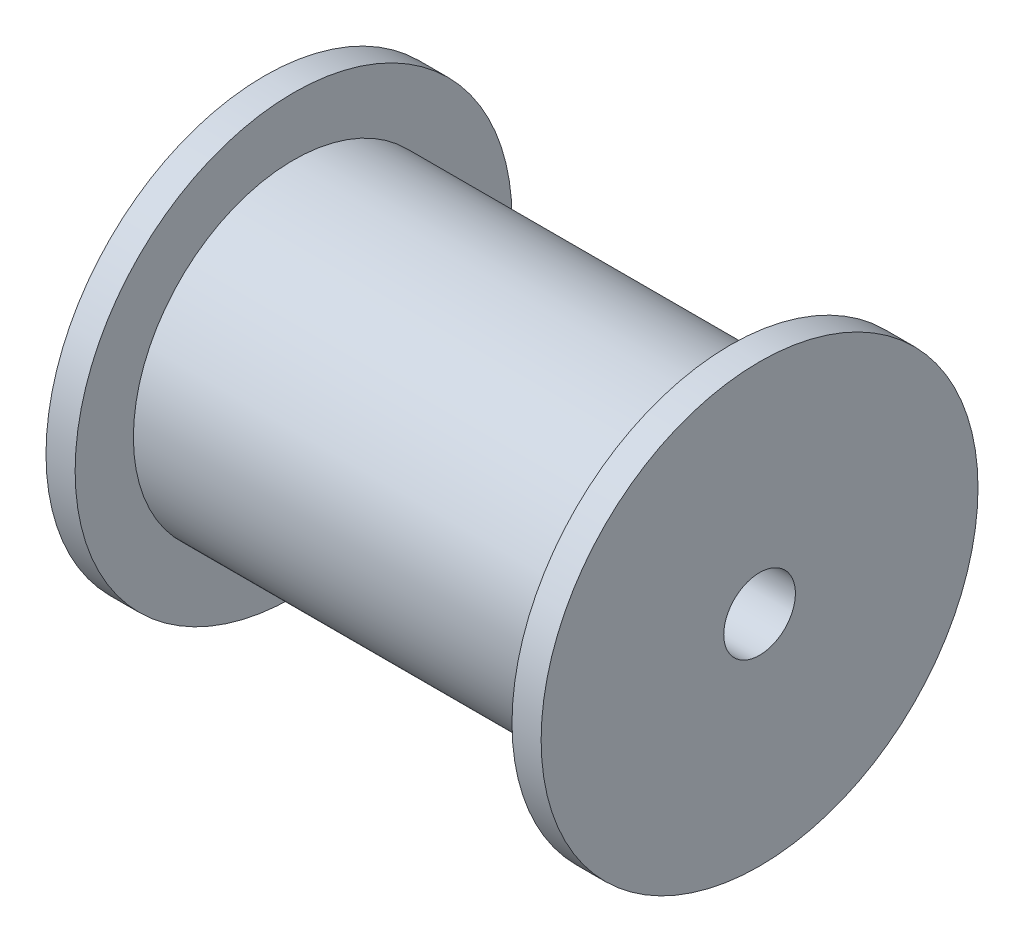
ISO-10303-21;
HEADER;
FILE_DESCRIPTION(('STEP AP214'),'2;1');
FILE_NAME('part.step','',(''),(''),'','','');
FILE_SCHEMA(('AUTOMOTIVE_DESIGN { 1 0 10303 214 1 1 1 1 }'));
ENDSEC;
DATA;
#1=APPLICATION_CONTEXT('core data for automotive mechanical design processes');
#2=APPLICATION_PROTOCOL_DEFINITION('international standard','automotive_design',2000,#1);
#3=PRODUCT_CONTEXT('',#1,'mechanical');
#4=PRODUCT('Part','Part','',(#3));
#5=PRODUCT_RELATED_PRODUCT_CATEGORY('part','',(#4));
#6=PRODUCT_DEFINITION_FORMATION('','',#4);
#7=PRODUCT_DEFINITION_CONTEXT('part definition',#1,'design');
#8=PRODUCT_DEFINITION('design','',#6,#7);
#9=PRODUCT_DEFINITION_SHAPE('','',#8);
#10=(LENGTH_UNIT() NAMED_UNIT(*) SI_UNIT(.MILLI.,.METRE.));
#11=(NAMED_UNIT(*) PLANE_ANGLE_UNIT() SI_UNIT($,.RADIAN.));
#12=(NAMED_UNIT(*) SI_UNIT($,.STERADIAN.) SOLID_ANGLE_UNIT());
#13=UNCERTAINTY_MEASURE_WITH_UNIT(LENGTH_MEASURE(1.E-05),#10,'distance_accuracy_value','');
#14=(GEOMETRIC_REPRESENTATION_CONTEXT(3) GLOBAL_UNCERTAINTY_ASSIGNED_CONTEXT((#13)) GLOBAL_UNIT_ASSIGNED_CONTEXT((#10,
#11,#12)) REPRESENTATION_CONTEXT('',''));
#15=CARTESIAN_POINT('',(0.,0.,0.));
#16=DIRECTION('',(0.,0.,1.));
#17=DIRECTION('',(1.,0.,0.));
#18=AXIS2_PLACEMENT_3D('',#15,#16,#17);
#19=CARTESIAN_POINT('',(25.4,0.,0.));
#20=DIRECTION('',(-1.,0.,0.));
#21=DIRECTION('',(0.,0.,1.));
#22=AXIS2_PLACEMENT_3D('',#19,#20,#21);
#23=PLANE('',#22);
#24=CARTESIAN_POINT('',(25.4,0.,0.));
#25=DIRECTION('',(-1.,0.,0.));
#26=DIRECTION('',(0.,0.,1.));
#27=AXIS2_PLACEMENT_3D('',#24,#25,#26);
#28=CIRCLE('',#27,3.1242);
#29=CARTESIAN_POINT('',(25.4,0.,3.1242));
#30=VERTEX_POINT('',#29);
#31=EDGE_CURVE('E61',#30,#30,#28,.T.);
#32=ORIENTED_EDGE('',*,*,#31,.T.);
#33=EDGE_LOOP('',(#32));
#34=FACE_BOUND('',#33,.T.);
#35=CARTESIAN_POINT('',(25.4,0.,0.));
#36=DIRECTION('',(-1.,0.,0.));
#37=DIRECTION('',(0.,0.,1.));
#38=AXIS2_PLACEMENT_3D('',#35,#36,#37);
#39=CIRCLE('',#38,19.05);
#40=CARTESIAN_POINT('',(25.4,0.,19.05));
#41=VERTEX_POINT('',#40);
#42=EDGE_CURVE('E10',#41,#41,#39,.T.);
#43=ORIENTED_EDGE('',*,*,#42,.F.);
#44=EDGE_LOOP('',(#43));
#45=FACE_BOUND('',#44,.T.);
#46=ADVANCED_FACE('F30',(#34,#45),#23,.F.);
#47=CARTESIAN_POINT('',(-25.4,0.,0.));
#48=DIRECTION('',(-1.,0.,0.));
#49=DIRECTION('',(0.,0.,1.));
#50=AXIS2_PLACEMENT_3D('',#47,#48,#49);
#51=CYLINDRICAL_SURFACE('',#50,19.05);
#52=CARTESIAN_POINT('',(22.86,0.,0.));
#53=DIRECTION('',(-1.,0.,0.));
#54=DIRECTION('',(0.,0.,1.));
#55=AXIS2_PLACEMENT_3D('',#52,#53,#54);
#56=CIRCLE('',#55,19.05);
#57=CARTESIAN_POINT('',(22.86,0.,19.05));
#58=VERTEX_POINT('',#57);
#59=EDGE_CURVE('E36',#58,#58,#56,.T.);
#60=ORIENTED_EDGE('',*,*,#59,.F.);
#61=EDGE_LOOP('',(#60));
#62=FACE_BOUND('',#61,.T.);
#63=ORIENTED_EDGE('',*,*,#42,.T.);
#64=EDGE_LOOP('',(#63));
#65=FACE_BOUND('',#64,.T.);
#66=ADVANCED_FACE('F114',(#62,#65),#51,.T.);
#67=CARTESIAN_POINT('',(22.86,19.05,0.));
#68=DIRECTION('',(1.,0.,0.));
#69=DIRECTION('',(0.,0.,-1.));
#70=AXIS2_PLACEMENT_3D('',#67,#68,#69);
#71=PLANE('',#70);
#72=CARTESIAN_POINT('',(22.86,0.,0.));
#73=DIRECTION('',(-1.,0.,0.));
#74=DIRECTION('',(0.,0.,1.));
#75=AXIS2_PLACEMENT_3D('',#72,#73,#74);
#76=CIRCLE('',#75,13.97);
#77=CARTESIAN_POINT('',(22.86,0.,13.97));
#78=VERTEX_POINT('',#77);
#79=EDGE_CURVE('E40',#78,#78,#76,.T.);
#80=ORIENTED_EDGE('',*,*,#79,.F.);
#81=EDGE_LOOP('',(#80));
#82=FACE_BOUND('',#81,.T.);
#83=ORIENTED_EDGE('',*,*,#59,.T.);
#84=EDGE_LOOP('',(#83));
#85=FACE_BOUND('',#84,.T.);
#86=ADVANCED_FACE('F109',(#82,#85),#71,.F.);
#87=CARTESIAN_POINT('',(-25.4,0.,0.));
#88=DIRECTION('',(-1.,0.,0.));
#89=DIRECTION('',(0.,0.,1.));
#90=AXIS2_PLACEMENT_3D('',#87,#88,#89);
#91=CYLINDRICAL_SURFACE('',#90,13.97);
#92=CARTESIAN_POINT('',(-15.24,0.,0.));
#93=DIRECTION('',(-1.,0.,0.));
#94=DIRECTION('',(0.,0.,1.));
#95=AXIS2_PLACEMENT_3D('',#92,#93,#94);
#96=CIRCLE('',#95,13.97);
#97=CARTESIAN_POINT('',(-15.24,0.,13.97));
#98=VERTEX_POINT('',#97);
#99=EDGE_CURVE('E44',#98,#98,#96,.T.);
#100=ORIENTED_EDGE('',*,*,#99,.F.);
#101=EDGE_LOOP('',(#100));
#102=FACE_BOUND('',#101,.T.);
#103=ORIENTED_EDGE('',*,*,#79,.T.);
#104=EDGE_LOOP('',(#103));
#105=FACE_BOUND('',#104,.T.);
#106=ADVANCED_FACE('F103',(#102,#105),#91,.T.);
#107=CARTESIAN_POINT('',(-15.24,13.97,0.));
#108=DIRECTION('',(-1.,0.,0.));
#109=DIRECTION('',(0.,0.,1.));
#110=AXIS2_PLACEMENT_3D('',#107,#108,#109);
#111=PLANE('',#110);
#112=CARTESIAN_POINT('',(-15.24,0.,0.));
#113=DIRECTION('',(-1.,0.,0.));
#114=DIRECTION('',(0.,0.,1.));
#115=AXIS2_PLACEMENT_3D('',#112,#113,#114);
#116=CIRCLE('',#115,19.05);
#117=CARTESIAN_POINT('',(-15.24,0.,19.05));
#118=VERTEX_POINT('',#117);
#119=EDGE_CURVE('E49',#118,#118,#116,.T.);
#120=ORIENTED_EDGE('',*,*,#119,.F.);
#121=EDGE_LOOP('',(#120));
#122=FACE_BOUND('',#121,.T.);
#123=ORIENTED_EDGE('',*,*,#99,.T.);
#124=EDGE_LOOP('',(#123));
#125=FACE_BOUND('',#124,.T.);
#126=ADVANCED_FACE('F97',(#122,#125),#111,.F.);
#127=CARTESIAN_POINT('',(-25.4,0.,0.));
#128=DIRECTION('',(-1.,0.,0.));
#129=DIRECTION('',(0.,0.,1.));
#130=AXIS2_PLACEMENT_3D('',#127,#128,#129);
#131=CYLINDRICAL_SURFACE('',#130,19.05);
#132=CARTESIAN_POINT('',(-17.78,0.,0.));
#133=DIRECTION('',(-1.,0.,0.));
#134=DIRECTION('',(0.,0.,1.));
#135=AXIS2_PLACEMENT_3D('',#132,#133,#134);
#136=CIRCLE('',#135,19.05);
#137=CARTESIAN_POINT('',(-17.78,0.,19.05));
#138=VERTEX_POINT('',#137);
#139=EDGE_CURVE('E52',#138,#138,#136,.T.);
#140=ORIENTED_EDGE('',*,*,#139,.F.);
#141=EDGE_LOOP('',(#140));
#142=FACE_BOUND('',#141,.T.);
#143=ORIENTED_EDGE('',*,*,#119,.T.);
#144=EDGE_LOOP('',(#143));
#145=FACE_BOUND('',#144,.T.);
#146=ADVANCED_FACE('F91',(#142,#145),#131,.T.);
#147=CARTESIAN_POINT('',(-17.78,19.05,0.));
#148=DIRECTION('',(1.,0.,0.));
#149=DIRECTION('',(0.,0.,-1.));
#150=AXIS2_PLACEMENT_3D('',#147,#148,#149);
#151=PLANE('',#150);
#152=CARTESIAN_POINT('',(-17.78,0.,0.));
#153=DIRECTION('',(-1.,0.,0.));
#154=DIRECTION('',(0.,0.,1.));
#155=AXIS2_PLACEMENT_3D('',#152,#153,#154);
#156=CIRCLE('',#155,6.35);
#157=CARTESIAN_POINT('',(-17.78,0.,6.35));
#158=VERTEX_POINT('',#157);
#159=EDGE_CURVE('E55',#158,#158,#156,.T.);
#160=ORIENTED_EDGE('',*,*,#159,.F.);
#161=EDGE_LOOP('',(#160));
#162=FACE_BOUND('',#161,.T.);
#163=ORIENTED_EDGE('',*,*,#139,.T.);
#164=EDGE_LOOP('',(#163));
#165=FACE_BOUND('',#164,.T.);
#166=ADVANCED_FACE('F85',(#162,#165),#151,.F.);
#167=CARTESIAN_POINT('',(-25.4,0.,0.));
#168=DIRECTION('',(-1.,0.,0.));
#169=DIRECTION('',(0.,0.,1.));
#170=AXIS2_PLACEMENT_3D('',#167,#168,#169);
#171=CYLINDRICAL_SURFACE('',#170,6.35);
#172=CARTESIAN_POINT('',(-25.4,0.,0.));
#173=DIRECTION('',(-1.,0.,0.));
#174=DIRECTION('',(0.,0.,1.));
#175=AXIS2_PLACEMENT_3D('',#172,#173,#174);
#176=CIRCLE('',#175,6.35);
#177=CARTESIAN_POINT('',(-25.4,0.,6.35));
#178=VERTEX_POINT('',#177);
#179=EDGE_CURVE('E58',#178,#178,#176,.T.);
#180=ORIENTED_EDGE('',*,*,#179,.F.);
#181=EDGE_LOOP('',(#180));
#182=FACE_BOUND('',#181,.T.);
#183=ORIENTED_EDGE('',*,*,#159,.T.);
#184=EDGE_LOOP('',(#183));
#185=FACE_BOUND('',#184,.T.);
#186=ADVANCED_FACE('F79',(#182,#185),#171,.T.);
#187=CARTESIAN_POINT('',(-25.4,6.35,0.));
#188=DIRECTION('',(1.,0.,0.));
#189=DIRECTION('',(0.,0.,-1.));
#190=AXIS2_PLACEMENT_3D('',#187,#188,#189);
#191=PLANE('',#190);
#192=CARTESIAN_POINT('',(-25.4,0.,0.));
#193=DIRECTION('',(-1.,0.,0.));
#194=DIRECTION('',(0.,0.,1.));
#195=AXIS2_PLACEMENT_3D('',#192,#193,#194);
#196=CIRCLE('',#195,3.1242);
#197=CARTESIAN_POINT('',(-25.4,0.,3.1242));
#198=VERTEX_POINT('',#197);
#199=EDGE_CURVE('E62',#198,#198,#196,.T.);
#200=ORIENTED_EDGE('',*,*,#199,.F.);
#201=EDGE_LOOP('',(#200));
#202=FACE_BOUND('',#201,.T.);
#203=ORIENTED_EDGE('',*,*,#179,.T.);
#204=EDGE_LOOP('',(#203));
#205=FACE_BOUND('',#204,.T.);
#206=ADVANCED_FACE('F73',(#202,#205),#191,.F.);
#207=CARTESIAN_POINT('',(25.4,0.,0.));
#208=DIRECTION('',(-1.,0.,0.));
#209=DIRECTION('',(0.,0.,1.));
#210=AXIS2_PLACEMENT_3D('',#207,#208,#209);
#211=CYLINDRICAL_SURFACE('',#210,3.1242);
#212=ORIENTED_EDGE('',*,*,#31,.F.);
#213=EDGE_LOOP('',(#212));
#214=FACE_BOUND('',#213,.T.);
#215=ORIENTED_EDGE('',*,*,#199,.T.);
#216=EDGE_LOOP('',(#215));
#217=FACE_BOUND('',#216,.T.);
#218=ADVANCED_FACE('F70',(#214,#217),#211,.F.);
#219=CLOSED_SHELL('',(#46,#66,#86,#106,#126,#146,#166,#186,#206,#218));
#220=MANIFOLD_SOLID_BREP('B2',#219);
#221=ADVANCED_BREP_SHAPE_REPRESENTATION('',(#18,#220),#14);
#222=SHAPE_DEFINITION_REPRESENTATION(#9,#221);
ENDSEC;
END-ISO-10303-21;
